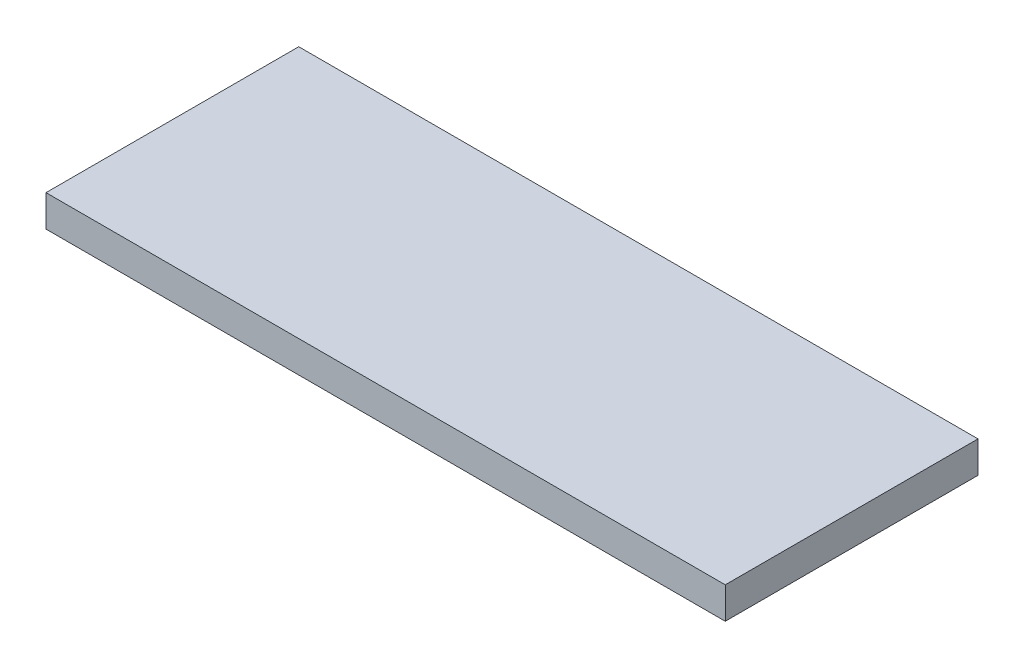
ISO-10303-21;
HEADER;
FILE_DESCRIPTION(('STEP AP214'),'2;1');
FILE_NAME('part.step','',(''),(''),'','','');
FILE_SCHEMA(('AUTOMOTIVE_DESIGN { 1 0 10303 214 1 1 1 1 }'));
ENDSEC;
DATA;
#1=APPLICATION_CONTEXT('core data for automotive mechanical design processes');
#2=APPLICATION_PROTOCOL_DEFINITION('international standard','automotive_design',2000,#1);
#3=PRODUCT_CONTEXT('',#1,'mechanical');
#4=PRODUCT('Part','Part','',(#3));
#5=PRODUCT_RELATED_PRODUCT_CATEGORY('part','',(#4));
#6=PRODUCT_DEFINITION_FORMATION('','',#4);
#7=PRODUCT_DEFINITION_CONTEXT('part definition',#1,'design');
#8=PRODUCT_DEFINITION('design','',#6,#7);
#9=PRODUCT_DEFINITION_SHAPE('','',#8);
#10=(LENGTH_UNIT() NAMED_UNIT(*) SI_UNIT(.MILLI.,.METRE.));
#11=(NAMED_UNIT(*) PLANE_ANGLE_UNIT() SI_UNIT($,.RADIAN.));
#12=(NAMED_UNIT(*) SI_UNIT($,.STERADIAN.) SOLID_ANGLE_UNIT());
#13=UNCERTAINTY_MEASURE_WITH_UNIT(LENGTH_MEASURE(1.E-05),#10,'distance_accuracy_value','');
#14=(GEOMETRIC_REPRESENTATION_CONTEXT(3) GLOBAL_UNCERTAINTY_ASSIGNED_CONTEXT((#13)) GLOBAL_UNIT_ASSIGNED_CONTEXT((#10,
#11,#12)) REPRESENTATION_CONTEXT('',''));
#15=CARTESIAN_POINT('',(0.,0.,0.));
#16=DIRECTION('',(0.,0.,1.));
#17=DIRECTION('',(1.,0.,0.));
#18=AXIS2_PLACEMENT_3D('',#15,#16,#17);
#19=CARTESIAN_POINT('',(-86.,8.,32.));
#20=DIRECTION('',(1.,0.,0.));
#21=DIRECTION('',(0.,0.,-1.));
#22=AXIS2_PLACEMENT_3D('',#19,#20,#21);
#23=PLANE('',#22);
#24=DIRECTION('',(0.,0.,1.));
#25=VECTOR('',#24,1.);
#26=CARTESIAN_POINT('',(-86.,0.,32.));
#27=LINE('',#26,#25);
#28=CARTESIAN_POINT('',(-86.,0.,-32.));
#29=VERTEX_POINT('',#28);
#30=CARTESIAN_POINT('',(-86.,0.,32.));
#31=VERTEX_POINT('',#30);
#32=EDGE_CURVE('E107',#29,#31,#27,.T.);
#33=ORIENTED_EDGE('',*,*,#32,.T.);
#34=DIRECTION('',(0.,-1.,0.));
#35=VECTOR('',#34,1.);
#36=CARTESIAN_POINT('',(-86.,8.,32.));
#37=LINE('',#36,#35);
#38=CARTESIAN_POINT('',(-86.,8.,32.));
#39=VERTEX_POINT('',#38);
#40=EDGE_CURVE('E11',#39,#31,#37,.T.);
#41=ORIENTED_EDGE('',*,*,#40,.F.);
#42=DIRECTION('',(0.,0.,1.));
#43=VECTOR('',#42,1.);
#44=CARTESIAN_POINT('',(-86.,8.,32.));
#45=LINE('',#44,#43);
#46=CARTESIAN_POINT('',(-86.,8.,-32.));
#47=VERTEX_POINT('',#46);
#48=EDGE_CURVE('E91',#47,#39,#45,.T.);
#49=ORIENTED_EDGE('',*,*,#48,.F.);
#50=DIRECTION('',(0.,-1.,0.));
#51=VECTOR('',#50,1.);
#52=CARTESIAN_POINT('',(-86.,8.,-32.));
#53=LINE('',#52,#51);
#54=EDGE_CURVE('E103',#47,#29,#53,.T.);
#55=ORIENTED_EDGE('',*,*,#54,.T.);
#56=EDGE_LOOP('',(#33,#41,#49,#55));
#57=FACE_BOUND('',#56,.T.);
#58=ADVANCED_FACE('F39',(#57),#23,.F.);
#59=CARTESIAN_POINT('',(86.,8.,32.));
#60=DIRECTION('',(0.,0.,-1.));
#61=DIRECTION('',(-1.,0.,0.));
#62=AXIS2_PLACEMENT_3D('',#59,#60,#61);
#63=PLANE('',#62);
#64=DIRECTION('',(1.,0.,0.));
#65=VECTOR('',#64,1.);
#66=CARTESIAN_POINT('',(86.,0.,32.));
#67=LINE('',#66,#65);
#68=CARTESIAN_POINT('',(86.,0.,32.));
#69=VERTEX_POINT('',#68);
#70=EDGE_CURVE('E96',#31,#69,#67,.T.);
#71=ORIENTED_EDGE('',*,*,#70,.T.);
#72=DIRECTION('',(0.,-1.,0.));
#73=VECTOR('',#72,1.);
#74=CARTESIAN_POINT('',(86.,8.,32.));
#75=LINE('',#74,#73);
#76=CARTESIAN_POINT('',(86.,8.,32.));
#77=VERTEX_POINT('',#76);
#78=EDGE_CURVE('E48',#77,#69,#75,.T.);
#79=ORIENTED_EDGE('',*,*,#78,.F.);
#80=DIRECTION('',(1.,0.,0.));
#81=VECTOR('',#80,1.);
#82=CARTESIAN_POINT('',(86.,8.,32.));
#83=LINE('',#82,#81);
#84=EDGE_CURVE('E86',#39,#77,#83,.T.);
#85=ORIENTED_EDGE('',*,*,#84,.F.);
#86=ORIENTED_EDGE('',*,*,#40,.T.);
#87=EDGE_LOOP('',(#71,#79,#85,#86));
#88=FACE_BOUND('',#87,.T.);
#89=ADVANCED_FACE('F95',(#88),#63,.F.);
#90=CARTESIAN_POINT('',(86.,8.,32.));
#91=DIRECTION('',(-1.,0.,0.));
#92=DIRECTION('',(0.,0.,1.));
#93=AXIS2_PLACEMENT_3D('',#90,#91,#92);
#94=PLANE('',#93);
#95=DIRECTION('',(0.,0.,-1.));
#96=VECTOR('',#95,1.);
#97=CARTESIAN_POINT('',(86.,0.,32.));
#98=LINE('',#97,#96);
#99=CARTESIAN_POINT('',(86.,0.,-32.));
#100=VERTEX_POINT('',#99);
#101=EDGE_CURVE('E73',#69,#100,#98,.T.);
#102=ORIENTED_EDGE('',*,*,#101,.T.);
#103=DIRECTION('',(0.,-1.,0.));
#104=VECTOR('',#103,1.);
#105=CARTESIAN_POINT('',(86.,8.,-32.));
#106=LINE('',#105,#104);
#107=CARTESIAN_POINT('',(86.,8.,-32.));
#108=VERTEX_POINT('',#107);
#109=EDGE_CURVE('E98',#108,#100,#106,.T.);
#110=ORIENTED_EDGE('',*,*,#109,.F.);
#111=DIRECTION('',(0.,0.,-1.));
#112=VECTOR('',#111,1.);
#113=CARTESIAN_POINT('',(86.,8.,32.));
#114=LINE('',#113,#112);
#115=EDGE_CURVE('E89',#77,#108,#114,.T.);
#116=ORIENTED_EDGE('',*,*,#115,.F.);
#117=ORIENTED_EDGE('',*,*,#78,.T.);
#118=EDGE_LOOP('',(#102,#110,#116,#117));
#119=FACE_BOUND('',#118,.T.);
#120=ADVANCED_FACE('F99',(#119),#94,.F.);
#121=CARTESIAN_POINT('',(86.,8.,-32.));
#122=DIRECTION('',(0.,0.,1.));
#123=DIRECTION('',(1.,0.,0.));
#124=AXIS2_PLACEMENT_3D('',#121,#122,#123);
#125=PLANE('',#124);
#126=DIRECTION('',(-1.,0.,0.));
#127=VECTOR('',#126,1.);
#128=CARTESIAN_POINT('',(86.,0.,-32.));
#129=LINE('',#128,#127);
#130=EDGE_CURVE('E79',#100,#29,#129,.T.);
#131=ORIENTED_EDGE('',*,*,#130,.T.);
#132=ORIENTED_EDGE('',*,*,#54,.F.);
#133=DIRECTION('',(-1.,0.,0.));
#134=VECTOR('',#133,1.);
#135=CARTESIAN_POINT('',(86.,8.,-32.));
#136=LINE('',#135,#134);
#137=EDGE_CURVE('E56',#108,#47,#136,.T.);
#138=ORIENTED_EDGE('',*,*,#137,.F.);
#139=ORIENTED_EDGE('',*,*,#109,.T.);
#140=EDGE_LOOP('',(#131,#132,#138,#139));
#141=FACE_BOUND('',#140,.T.);
#142=ADVANCED_FACE('F120',(#141),#125,.F.);
#143=CARTESIAN_POINT('',(0.,8.,0.));
#144=DIRECTION('',(0.,1.,0.));
#145=DIRECTION('',(0.,0.,1.));
#146=AXIS2_PLACEMENT_3D('',#143,#144,#145);
#147=PLANE('',#146);
#148=ORIENTED_EDGE('',*,*,#48,.T.);
#149=ORIENTED_EDGE('',*,*,#84,.T.);
#150=ORIENTED_EDGE('',*,*,#115,.T.);
#151=ORIENTED_EDGE('',*,*,#137,.T.);
#152=EDGE_LOOP('',(#148,#149,#150,#151));
#153=FACE_BOUND('',#152,.T.);
#154=ADVANCED_FACE('F87',(#153),#147,.T.);
#155=CARTESIAN_POINT('',(0.,0.,0.));
#156=DIRECTION('',(0.,1.,0.));
#157=DIRECTION('',(0.,0.,1.));
#158=AXIS2_PLACEMENT_3D('',#155,#156,#157);
#159=PLANE('',#158);
#160=ORIENTED_EDGE('',*,*,#32,.F.);
#161=ORIENTED_EDGE('',*,*,#130,.F.);
#162=ORIENTED_EDGE('',*,*,#101,.F.);
#163=ORIENTED_EDGE('',*,*,#70,.F.);
#164=EDGE_LOOP('',(#160,#161,#162,#163));
#165=FACE_BOUND('',#164,.T.);
#166=ADVANCED_FACE('F123',(#165),#159,.F.);
#167=CLOSED_SHELL('',(#58,#89,#120,#142,#154,#166));
#168=MANIFOLD_SOLID_BREP('B2',#167);
#169=ADVANCED_BREP_SHAPE_REPRESENTATION('',(#18,#168),#14);
#170=SHAPE_DEFINITION_REPRESENTATION(#9,#169);
ENDSEC;
END-ISO-10303-21;
